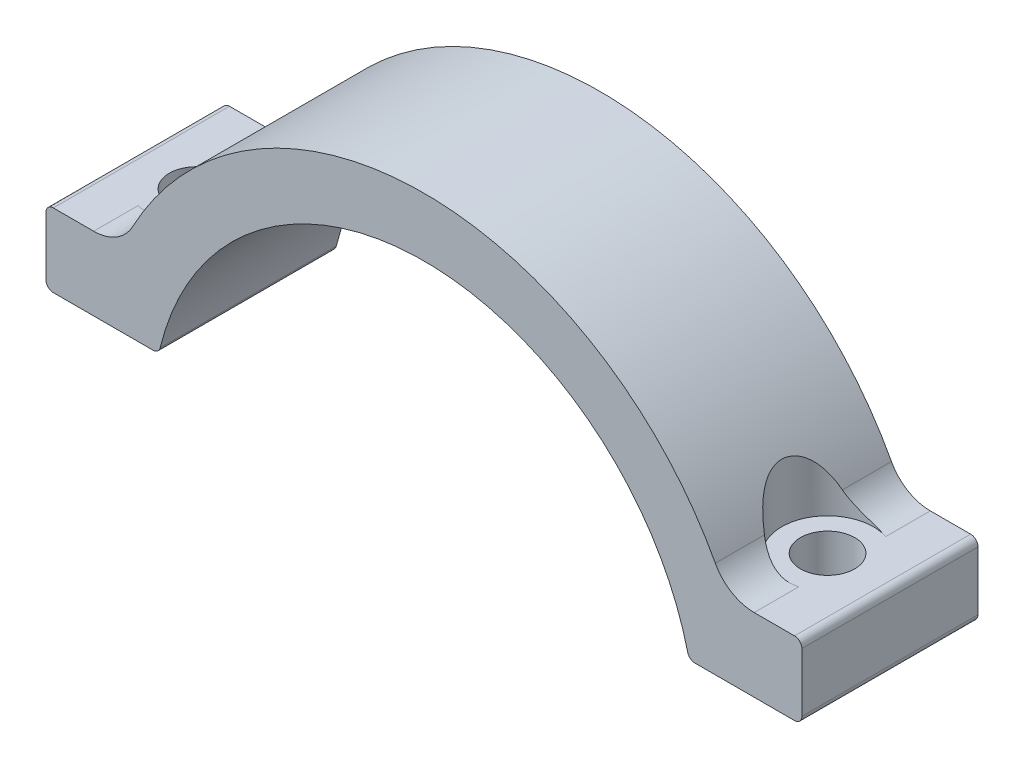
ISO-10303-21;
HEADER;
FILE_DESCRIPTION(('STEP AP214'),'2;1');
FILE_NAME('part.step','',(''),(''),'','','');
FILE_SCHEMA(('AUTOMOTIVE_DESIGN { 1 0 10303 214 1 1 1 1 }'));
ENDSEC;
DATA;
#1=APPLICATION_CONTEXT('core data for automotive mechanical design processes');
#2=APPLICATION_PROTOCOL_DEFINITION('international standard','automotive_design',2000,#1);
#3=PRODUCT_CONTEXT('',#1,'mechanical');
#4=PRODUCT('Part','Part','',(#3));
#5=PRODUCT_RELATED_PRODUCT_CATEGORY('part','',(#4));
#6=PRODUCT_DEFINITION_FORMATION('','',#4);
#7=PRODUCT_DEFINITION_CONTEXT('part definition',#1,'design');
#8=PRODUCT_DEFINITION('design','',#6,#7);
#9=PRODUCT_DEFINITION_SHAPE('','',#8);
#10=(LENGTH_UNIT() NAMED_UNIT(*) SI_UNIT(.MILLI.,.METRE.));
#11=(NAMED_UNIT(*) PLANE_ANGLE_UNIT() SI_UNIT($,.RADIAN.));
#12=(NAMED_UNIT(*) SI_UNIT($,.STERADIAN.) SOLID_ANGLE_UNIT());
#13=UNCERTAINTY_MEASURE_WITH_UNIT(LENGTH_MEASURE(1.E-05),#10,'distance_accuracy_value','');
#14=(GEOMETRIC_REPRESENTATION_CONTEXT(3) GLOBAL_UNCERTAINTY_ASSIGNED_CONTEXT((#13)) GLOBAL_UNIT_ASSIGNED_CONTEXT((#10,
#11,#12)) REPRESENTATION_CONTEXT('',''));
#15=CARTESIAN_POINT('',(0.,0.,0.));
#16=DIRECTION('',(0.,0.,1.));
#17=DIRECTION('',(1.,0.,0.));
#18=AXIS2_PLACEMENT_3D('',#15,#16,#17);
#19=CARTESIAN_POINT('',(21.5,16.,0.));
#20=DIRECTION('',(0.,1.,0.));
#21=DIRECTION('',(0.,0.,1.));
#22=AXIS2_PLACEMENT_3D('',#19,#20,#21);
#23=CYLINDRICAL_SURFACE('',#22,3.124999973);
#24=CARTESIAN_POINT('',(19.8529411764706,6.58823529411761,2.65571498152267));
#25=CARTESIAN_POINT('',(19.8920781094993,6.51487753456546,2.67999030792924));
#26=CARTESIAN_POINT('',(19.9341389070423,6.44333371631151,2.70487575965419));
#27=CARTESIAN_POINT('',(20.0240110827139,6.3040137521799,2.75494546873446));
#28=CARTESIAN_POINT('',(20.0718250480102,6.23623932155781,2.78012985589634));
#29=CARTESIAN_POINT('',(20.2249018744497,6.03730703423959,2.85530696334734));
#30=CARTESIAN_POINT('',(20.3388613070314,5.91230098157151,2.90429929640925));
#31=CARTESIAN_POINT('',(20.5891505198039,5.6810095636425,2.99225598345711));
#32=CARTESIAN_POINT('',(20.7255814303287,5.57481355356508,3.03117285836352));
#33=CARTESIAN_POINT('',(20.9438539742872,5.43370253366546,3.07600769508487));
#34=CARTESIAN_POINT('',(21.018626863033,5.38980555668679,3.08867712771184));
#35=CARTESIAN_POINT('',(21.172228722284,5.30842985878955,3.10872431854378));
#36=CARTESIAN_POINT('',(21.2510530519513,5.27094399815755,3.11610799280413));
#37=CARTESIAN_POINT('',(21.3591831151485,5.22521259415585,3.12194940729997));
#38=CARTESIAN_POINT('',(21.3870907298733,5.21390263064233,3.12308564190363));
#39=CARTESIAN_POINT('',(21.4432712206021,5.19211214083195,3.12461171477608));
#40=CARTESIAN_POINT('',(21.4715443719884,5.18163228805802,3.12500095278641));
#41=CARTESIAN_POINT('',(21.6176965000103,5.12996572639633,3.12499591669571));
#42=CARTESIAN_POINT('',(21.7382032084086,5.09567570689726,3.11830468931954));
#43=CARTESIAN_POINT('',(21.9810181762615,5.04261753281015,3.0901749884772));
#44=CARTESIAN_POINT('',(22.1033278916025,5.02386271017067,3.06872387725488));
#45=CARTESIAN_POINT('',(22.2708756036,5.00839569834034,3.02880756680948));
#46=CARTESIAN_POINT('',(22.3171505039234,5.00522228557254,3.01665175064189));
#47=CARTESIAN_POINT('',(22.4090607040716,5.00102765695331,2.9902354828748));
#48=CARTESIAN_POINT('',(22.4546973839482,5.00000070534107,2.97598074952103));
#49=CARTESIAN_POINT('',(22.4999985267468,5.00000000000036,2.96068028968923));
#50=B_SPLINE_CURVE_WITH_KNOTS('',3,(#24,#25,#26,#27,#28,#29,#30,#31,#32,#33,#34,#35,#36,#37,#38,
#39,#40,#41,#42,#43,#44,#45,#46,#47,#48,#49),.UNSPECIFIED.,.F.,.F.,(4,2,2,2,2,2,2,2,2,2,2,2,4),
(0.,0.259694540226182,0.519506303202874,1.04533013778207,1.57358850123147,1.83607602251771,
2.09826929483037,2.18865188936675,2.27910708160784,2.65356339005359,3.02834071633228,
3.17211213946567,3.31549888369353),.UNSPECIFIED.);
#51=CARTESIAN_POINT('',(19.8529411764706,6.58823529411763,2.65571498152266));
#52=VERTEX_POINT('',#51);
#53=CARTESIAN_POINT('',(22.499998158362,5.000000078,2.9606804141141));
#54=VERTEX_POINT('',#53);
#55=EDGE_CURVE('E237',#52,#54,#50,.T.);
#56=ORIENTED_EDGE('',*,*,#55,.T.);
#57=CARTESIAN_POINT('',(21.5,5.000000156,0.));
#58=DIRECTION('',(0.,1.,0.));
#59=DIRECTION('',(0.,0.,1.));
#60=AXIS2_PLACEMENT_3D('',#57,#58,#59);
#61=CIRCLE('',#60,3.124999973);
#62=CARTESIAN_POINT('',(22.4999987771713,5.00000005178879,-2.96080443941355));
#63=VERTEX_POINT('',#62);
#64=EDGE_CURVE('E242',#54,#63,#61,.F.);
#65=ORIENTED_EDGE('',*,*,#64,.T.);
#66=CARTESIAN_POINT('',(22.4999611139855,5.00000000025202,-2.96069292594941));
#67=CARTESIAN_POINT('',(22.4405723898165,4.99998887790282,-2.98076450661719));
#68=CARTESIAN_POINT('',(22.3805645614575,5.00176467046286,-2.99902808956596));
#69=CARTESIAN_POINT('',(22.2597413929983,5.00902668583251,-3.03188358947512));
#70=CARTESIAN_POINT('',(22.1989256576369,5.014514795721,-3.04647363389053));
#71=CARTESIAN_POINT('',(22.0773627590128,5.02929165176531,-3.07182574473477));
#72=CARTESIAN_POINT('',(22.0166175762853,5.03855624295259,-3.08261134188317));
#73=CARTESIAN_POINT('',(21.8953263176081,5.06092395670118,-3.10049933661798));
#74=CARTESIAN_POINT('',(21.8347801468096,5.07402485573171,-3.10760386117312));
#75=CARTESIAN_POINT('',(21.7282979099296,5.1005600901545,-3.1169956253903));
#76=CARTESIAN_POINT('',(21.6822288561805,5.11321301049284,-3.12001782360413));
#77=CARTESIAN_POINT('',(21.5906497844057,5.14074036535155,-3.12402226103625));
#78=CARTESIAN_POINT('',(21.5451400308609,5.15561581018278,-3.12500356946822));
#79=CARTESIAN_POINT('',(21.4284649658354,5.19687028748763,-3.12500339570786));
#80=CARTESIAN_POINT('',(21.3578669818989,5.22488790152946,-3.12253771139284));
#81=CARTESIAN_POINT('',(21.2192292227496,5.28607418333002,-3.11313801104424));
#82=CARTESIAN_POINT('',(21.1511913762788,5.31924664178451,-3.10620069481222));
#83=CARTESIAN_POINT('',(20.9513996108179,5.42616579832855,-3.07939956032397));
#84=CARTESIAN_POINT('',(20.8242506757207,5.50721327720102,-3.05355035912359));
#85=CARTESIAN_POINT('',(20.5864583874196,5.68477355255953,-2.99100534334149));
#86=CARTESIAN_POINT('',(20.4756773683158,5.78114129267246,-2.95440877659872));
#87=CARTESIAN_POINT('',(20.2704466838855,5.98748310502331,-2.87504596703094));
#88=CARTESIAN_POINT('',(20.1759790090353,6.09744193984825,-2.83228662471535));
#89=CARTESIAN_POINT('',(20.0459449207383,6.27283288487622,-2.76655011639467));
#90=CARTESIAN_POINT('',(20.004085974742,6.33389416879613,-2.74407201480064));
#91=CARTESIAN_POINT('',(19.92502972259,6.45890573309817,-2.69947177006923));
#92=CARTESIAN_POINT('',(19.887823531304,6.52285017964949,-2.67734902102541));
#93=CARTESIAN_POINT('',(19.8529411764706,6.58823529411757,-2.65571498152268));
#94=B_SPLINE_CURVE_WITH_KNOTS('',3,(#66,#67,#68,#69,#70,#71,#72,#73,#74,#75,#76,#77,#78,#79,#80,
#81,#82,#83,#84,#85,#86,#87,#88,#89,#90,#91,#92,#93),.UNSPECIFIED.,.F.,.F.,(4,2,2,2,2,2,2,2,2,2,
2,2,2,4),(0.,0.188024105822827,0.376143861665363,0.563078796674835,0.749905597600661,
0.893420203269972,1.03700024714419,1.26458113944053,1.49233018587098,1.94871641429392,
2.4010139480001,2.8528089192811,3.08474942469126,3.3162400124577),.UNSPECIFIED.);
#95=CARTESIAN_POINT('',(19.8529411764706,6.58823529411757,-2.65571498152268));
#96=VERTEX_POINT('',#95);
#97=EDGE_CURVE('E335',#63,#96,#94,.T.);
#98=ORIENTED_EDGE('',*,*,#97,.T.);
#99=CARTESIAN_POINT('',(19.8529411764706,6.58823529411761,2.65571498152267));
#100=CARTESIAN_POINT('',(19.816469666707,6.6566204307584,2.6330917713851));
#101=CARTESIAN_POINT('',(19.7798037269385,6.72451661172181,2.60931549629452));
#102=CARTESIAN_POINT('',(19.7061630304444,6.85923721460095,2.55925003949798));
#103=CARTESIAN_POINT('',(19.6691881744957,6.92606127031289,2.53296001965382));
#104=CARTESIAN_POINT('',(19.5575390108029,7.12546309479266,2.44972093739964));
#105=CARTESIAN_POINT('',(19.4825537161557,7.25619616690696,2.3886534670583));
#106=CARTESIAN_POINT('',(19.3316590135644,7.51345242353353,2.25264889854558));
#107=CARTESIAN_POINT('',(19.2557562786011,7.63986251559669,2.17748860969635));
#108=CARTESIAN_POINT('',(19.1063246895172,7.88354591732747,2.01204674462127));
#109=CARTESIAN_POINT('',(19.0327899757857,8.00084298968834,1.92180657117554));
#110=CARTESIAN_POINT('',(18.9318442364886,8.15888144535122,1.78124269019669));
#111=CARTESIAN_POINT('',(18.9023548137475,8.20466319233931,1.73801878291661));
#112=CARTESIAN_POINT('',(18.8445435910911,8.29373799662982,1.64833957915152));
#113=CARTESIAN_POINT('',(18.816221866453,8.33703089355626,1.60188407485489));
#114=CARTESIAN_POINT('',(18.7336311095318,8.46238402300342,1.45776432524967));
#115=CARTESIAN_POINT('',(18.6815295585943,8.54024109664914,1.35506607783926));
#116=CARTESIAN_POINT('',(18.5856243587585,8.68195628990993,1.13430652258093));
#117=CARTESIAN_POINT('',(18.5419433650117,8.74560934629763,1.01605505618366));
#118=CARTESIAN_POINT('',(18.4863645069398,8.82596579943541,0.829368355040395));
#119=CARTESIAN_POINT('',(18.4694978948331,8.85022715589567,0.765602638571849));
#120=CARTESIAN_POINT('',(18.4395453479116,8.89317057854466,0.635377413788864));
#121=CARTESIAN_POINT('',(18.4264578503593,8.91185495103305,0.568919031945583));
#122=CARTESIAN_POINT('',(18.3993743920121,8.9504376010663,0.402242515551578));
#123=CARTESIAN_POINT('',(18.3878146255899,8.96681900854814,0.300767960581489));
#124=CARTESIAN_POINT('',(18.3747879886154,8.98527241225864,0.0959349221375464));
#125=CARTESIAN_POINT('',(18.3733159536642,8.98735173042242,-0.0074225701902728));
#126=CARTESIAN_POINT('',(18.3805726975854,8.97707911283496,-0.213014144105989));
#127=CARTESIAN_POINT('',(18.3892983925873,8.96473153988474,-0.315248555886697));
#128=CARTESIAN_POINT('',(18.416206664836,8.92647927680355,-0.51585417689658));
#129=CARTESIAN_POINT('',(18.4343942884768,8.90056735225985,-0.614223294482389));
#130=CARTESIAN_POINT('',(18.4795162483935,8.83585060080591,-0.807755235299555));
#131=CARTESIAN_POINT('',(18.5066882722243,8.7966946657342,-0.902743124444346));
#132=CARTESIAN_POINT('',(18.5678580226087,8.707775865836,-1.08509432166317));
#133=CARTESIAN_POINT('',(18.6018537602963,8.65801609138543,-1.17245984076251));
#134=CARTESIAN_POINT('',(18.6978800395477,8.51600697437626,-1.39126756432365));
#135=CARTESIAN_POINT('',(18.7641697544556,8.41661588769717,-1.51620723101444));
#136=CARTESIAN_POINT('',(18.9050636467446,8.20103746307037,-1.7465260907328));
#137=CARTESIAN_POINT('',(18.9797258135602,8.08473108233849,-1.85175342464139));
#138=CARTESIAN_POINT('',(19.1214698906392,7.85893902762125,-2.02955664680287));
#139=CARTESIAN_POINT('',(19.1880018833681,7.75106050443792,-2.10466312780188));
#140=CARTESIAN_POINT('',(19.3223987861146,7.52873847171447,-2.24343958542842));
#141=CARTESIAN_POINT('',(19.3902655981622,7.41428506856189,-2.30709169798858));
#142=CARTESIAN_POINT('',(19.5245012081146,7.18308059311626,-2.42295824787583));
#143=CARTESIAN_POINT('',(19.5908689471603,7.06644109265621,-2.47540002013258));
#144=CARTESIAN_POINT('',(19.7226984819885,6.8297552711605,-2.57165009555213));
#145=CARTESIAN_POINT('',(19.7881626712043,6.70972264884614,-2.6154886488346));
#146=CARTESIAN_POINT('',(19.8529411764706,6.58823529411757,-2.65571498152269));
#147=B_SPLINE_CURVE_WITH_KNOTS('',3,(#99,#100,#101,#102,#103,#104,#105,#106,#107,#108,#109,#110,
#111,#112,#113,#114,#115,#116,#117,#118,#119,#120,#121,#122,#123,#124,#125,#126,#127,#128,#129,
#130,#131,#132,#133,#134,#135,#136,#137,#138,#139,#140,#141,#142,#143,#144,#145,#146),
.UNSPECIFIED.,.F.,.F.,(4,2,2,2,2,2,2,2,2,2,2,2,2,2,2,2,2,2,2,2,2,2,2,4),(0.,0.242191341778566,
0.484463718991839,0.971741314902481,1.46751197924966,1.96194318840496,2.17041114975584,
2.37889252929649,2.79444097501855,3.21564802132588,3.42616068691039,3.63658617632711,
3.94539573375019,4.25404718476646,4.56260532140151,4.87132819238534,5.18897708776863,
5.50653353406748,6.02218824924471,6.54166530986681,6.98297400113076,7.42496509626059,
7.8568971801909,8.28728219327679),.UNSPECIFIED.);
#148=EDGE_CURVE('E233',#52,#96,#147,.T.);
#149=ORIENTED_EDGE('',*,*,#148,.F.);
#150=EDGE_LOOP('',(#56,#65,#98,#149));
#151=FACE_BOUND('',#150,.T.);
#152=ADVANCED_FACE('F14',(#151),#23,.F.);
#153=CARTESIAN_POINT('',(-21.5,16.,0.));
#154=DIRECTION('',(0.,1.,0.));
#155=DIRECTION('',(0.,0.,1.));
#156=AXIS2_PLACEMENT_3D('',#153,#154,#155);
#157=CYLINDRICAL_SURFACE('',#156,3.124999973);
#158=CARTESIAN_POINT('',(-22.499998536605,5.00000003119989,2.96068031929062));
#159=CARTESIAN_POINT('',(-22.4406099990688,4.99998817154151,2.98075267890423));
#160=CARTESIAN_POINT('',(-22.3806023041315,5.00176318481452,2.99901702635265));
#161=CARTESIAN_POINT('',(-22.2597793107503,5.00902362801093,3.03187407381437));
#162=CARTESIAN_POINT('',(-22.1989636170038,5.01451094497957,3.04646490131872));
#163=CARTESIAN_POINT('',(-22.0774006768684,5.02928628330548,3.07181864851276));
#164=CARTESIAN_POINT('',(-22.0166554112658,5.03855015225284,3.08260509566519));
#165=CARTESIAN_POINT('',(-21.8953637942989,5.06091616047165,3.10049447473786));
#166=CARTESIAN_POINT('',(-21.8348173481986,5.07401607640233,3.10759953377217));
#167=CARTESIAN_POINT('',(-21.7283255990484,5.10055281237428,3.11699398668421));
#168=CARTESIAN_POINT('',(-21.6822473316431,5.11320845124196,3.12001770090253));
#169=CARTESIAN_POINT('',(-21.5906491521919,5.14073956100516,3.12402160355263));
#170=CARTESIAN_POINT('',(-21.5451295042162,5.15561604106674,3.12500085992097));
#171=CARTESIAN_POINT('',(-21.4284447760832,5.196873281839,3.12499856738199));
#172=CARTESIAN_POINT('',(-21.3578477218238,5.22489451544327,3.1225356494578));
#173=CARTESIAN_POINT('',(-21.2192105376052,5.28608431985702,3.11313750027757));
#174=CARTESIAN_POINT('',(-21.1511723362572,5.31925668018474,3.1061989645052));
#175=CARTESIAN_POINT('',(-20.9513799684373,5.42617660734552,3.07939527744612));
#176=CARTESIAN_POINT('',(-20.8242312741671,5.50722601633853,3.05354585866783));
#177=CARTESIAN_POINT('',(-20.5864394517983,5.68478943082776,2.99099976186109));
#178=CARTESIAN_POINT('',(-20.4756586594944,5.78115838812692,2.95440233622458));
#179=CARTESIAN_POINT('',(-20.2704287882439,5.98750280907188,2.87503825473775));
#180=CARTESIAN_POINT('',(-20.1759616900654,6.09746302711194,2.83227850251952));
#181=CARTESIAN_POINT('',(-20.0459316368905,6.27285197032742,2.76654307507206));
#182=CARTESIAN_POINT('',(-20.0040757680808,6.33390967243067,2.7440664014066));
#183=CARTESIAN_POINT('',(-19.9250250624831,6.45891373535674,2.69946899660184));
#184=CARTESIAN_POINT('',(-19.8878213450563,6.52285426532679,2.67734765978022));
#185=CARTESIAN_POINT('',(-19.8529411764706,6.58823529411754,2.65571498152269));
#186=B_SPLINE_CURVE_WITH_KNOTS('',3,(#158,#159,#160,#161,#162,#163,#164,#165,#166,#167,#168,
#169,#170,#171,#172,#173,#174,#175,#176,#177,#178,#179,#180,#181,#182,#183,#184,#185),
.UNSPECIFIED.,.F.,.F.,(4,2,2,2,2,2,2,2,2,2,2,2,2,4),(0.,0.188024325081057,0.37614429892747,
0.563079594275378,0.749906757213932,0.893450354519204,1.03705937872928,1.26464139837043,
1.49239164297864,1.94878034380683,2.4010803782355,2.85287758572648,3.08480340892054,
3.31627951432019),.UNSPECIFIED.);
#187=CARTESIAN_POINT('',(-22.4999992633106,5.00000007800018,2.96068004090744));
#188=VERTEX_POINT('',#187);
#189=CARTESIAN_POINT('',(-19.8529411764706,6.5882352941176,2.65571498152268));
#190=VERTEX_POINT('',#189);
#191=EDGE_CURVE('E217',#188,#190,#186,.T.);
#192=ORIENTED_EDGE('',*,*,#191,.T.);
#193=CARTESIAN_POINT('',(-19.8529411764706,6.58823529411758,-2.65571498152268));
#194=CARTESIAN_POINT('',(-19.816469666707,6.65662043075837,-2.63309177138511));
#195=CARTESIAN_POINT('',(-19.7798037269385,6.72451661172178,-2.60931549629453));
#196=CARTESIAN_POINT('',(-19.7061630304444,6.85923721460092,-2.55925003949799));
#197=CARTESIAN_POINT('',(-19.6691881744957,6.92606127031286,-2.53296001965383));
#198=CARTESIAN_POINT('',(-19.5575390108029,7.12546309479264,-2.44972093739965));
#199=CARTESIAN_POINT('',(-19.4825537161557,7.25619616690694,-2.38865346705831));
#200=CARTESIAN_POINT('',(-19.3316590135644,7.51345242353351,-2.25264889854559));
#201=CARTESIAN_POINT('',(-19.2557562786011,7.63986251559667,-2.17748860969636));
#202=CARTESIAN_POINT('',(-19.1063246895173,7.88354591732746,-2.01204674462128));
#203=CARTESIAN_POINT('',(-19.0327899757857,8.00084298968833,-1.92180657117555));
#204=CARTESIAN_POINT('',(-18.9318442364886,8.15888144535121,-1.7812426901967));
#205=CARTESIAN_POINT('',(-18.9023548137475,8.20466319233931,-1.73801878291662));
#206=CARTESIAN_POINT('',(-18.8445435910911,8.29373799662981,-1.64833957915153));
#207=CARTESIAN_POINT('',(-18.816221866453,8.33703089355625,-1.6018840748549));
#208=CARTESIAN_POINT('',(-18.7336311095318,8.4623840230034,-1.45776432524968));
#209=CARTESIAN_POINT('',(-18.6815295585943,8.54024109664914,-1.35506607783927));
#210=CARTESIAN_POINT('',(-18.5856243587585,8.68195628990993,-1.13430652258094));
#211=CARTESIAN_POINT('',(-18.5419433650117,8.74560934629762,-1.01605505618367));
#212=CARTESIAN_POINT('',(-18.4863645069399,8.82596579943541,-0.829368355040403));
#213=CARTESIAN_POINT('',(-18.4694978948331,8.85022715589566,-0.765602638571857));
#214=CARTESIAN_POINT('',(-18.4395453479116,8.89317057854465,-0.635377413788872));
#215=CARTESIAN_POINT('',(-18.4264578503593,8.91185495103304,-0.568919031945591));
#216=CARTESIAN_POINT('',(-18.3993743920121,8.9504376010663,-0.402242515551585));
#217=CARTESIAN_POINT('',(-18.3878146255899,8.96681900854814,-0.300767960581496));
#218=CARTESIAN_POINT('',(-18.3747879886154,8.98527241225864,-0.0959349221375543));
#219=CARTESIAN_POINT('',(-18.3733159536642,8.98735173042242,0.0074225701902652));
#220=CARTESIAN_POINT('',(-18.3805726975854,8.97707911283496,0.213014144105982));
#221=CARTESIAN_POINT('',(-18.3892983925873,8.96473153988474,0.315248555886691));
#222=CARTESIAN_POINT('',(-18.416206664836,8.92647927680355,0.515854176896574));
#223=CARTESIAN_POINT('',(-18.4343942884768,8.90056735225985,0.614223294482383));
#224=CARTESIAN_POINT('',(-18.4795162483935,8.83585060080591,0.80775523529955));
#225=CARTESIAN_POINT('',(-18.5066882722243,8.7966946657342,0.902743124444341));
#226=CARTESIAN_POINT('',(-18.5678580226087,8.707775865836,1.08509432166317));
#227=CARTESIAN_POINT('',(-18.6018537602963,8.65801609138543,1.1724598407625));
#228=CARTESIAN_POINT('',(-18.6978800395477,8.51600697437626,1.39126756432364));
#229=CARTESIAN_POINT('',(-18.7641697544556,8.41661588769717,1.51620723101443));
#230=CARTESIAN_POINT('',(-18.9050636467446,8.20103746307038,1.74652609073279));
#231=CARTESIAN_POINT('',(-18.9797258135602,8.0847310823385,1.85175342464139));
#232=CARTESIAN_POINT('',(-19.1214698906392,7.85893902762125,2.02955664680287));
#233=CARTESIAN_POINT('',(-19.1880018833681,7.75106050443793,2.10466312780188));
#234=CARTESIAN_POINT('',(-19.3223987861146,7.52873847171446,2.24343958542843));
#235=CARTESIAN_POINT('',(-19.3902655981622,7.41428506856188,2.30709169798859));
#236=CARTESIAN_POINT('',(-19.5245012081146,7.18308059311624,2.42295824787583));
#237=CARTESIAN_POINT('',(-19.5908689471603,7.06644109265619,2.47540002013259));
#238=CARTESIAN_POINT('',(-19.7226984819886,6.82975527116048,2.57165009555214));
#239=CARTESIAN_POINT('',(-19.7881626712043,6.70972264884612,2.6154886488346));
#240=CARTESIAN_POINT('',(-19.8529411764706,6.58823529411754,2.65571498152269));
#241=B_SPLINE_CURVE_WITH_KNOTS('',3,(#193,#194,#195,#196,#197,#198,#199,#200,#201,#202,#203,
#204,#205,#206,#207,#208,#209,#210,#211,#212,#213,#214,#215,#216,#217,#218,#219,#220,#221,#222,
#223,#224,#225,#226,#227,#228,#229,#230,#231,#232,#233,#234,#235,#236,#237,#238,#239,#240),
.UNSPECIFIED.,.F.,.F.,(4,2,2,2,2,2,2,2,2,2,2,2,2,2,2,2,2,2,2,2,2,2,2,4),(0.,0.242191341778567,
0.484463718991838,0.971741314902488,1.46751197924967,1.96194318840498,2.17041114975586,
2.37889252929651,2.79444097501857,3.2156480213259,3.42616068691041,3.63658617632713,
3.94539573375021,4.25404718476648,4.56260532140153,4.87132819238536,5.18897708776865,
5.5065335340675,6.02218824924473,6.54166530986683,6.9829740011308,7.42496509626064,
7.85689718019096,8.28728219327685),.UNSPECIFIED.);
#242=CARTESIAN_POINT('',(-19.8529411764706,6.58823529411762,-2.65571498152267));
#243=VERTEX_POINT('',#242);
#244=EDGE_CURVE('E227',#243,#190,#241,.T.);
#245=ORIENTED_EDGE('',*,*,#244,.F.);
#246=CARTESIAN_POINT('',(-19.8529411764706,6.58823529411758,-2.65571498152268));
#247=CARTESIAN_POINT('',(-19.8920781103441,6.51487753299697,-2.67999030844833));
#248=CARTESIAN_POINT('',(-19.9341389088426,6.44333371325629,-2.70487576071701));
#249=CARTESIAN_POINT('',(-20.0240110865607,6.30401374648179,-2.7549454708178));
#250=CARTESIAN_POINT('',(-20.0718250529345,6.23623931469465,-2.7801298584558));
#251=CARTESIAN_POINT('',(-20.2249018790103,6.03730702925174,-2.8553069653016));
#252=CARTESIAN_POINT('',(-20.338861309621,5.91230097922691,-2.90429929729123));
#253=CARTESIAN_POINT('',(-20.5891505184661,5.68100956483007,-2.99225598301518));
#254=CARTESIAN_POINT('',(-20.7255814272505,5.57481355583461,-3.03117285756769));
#255=CARTESIAN_POINT('',(-20.9438539698108,5.43370253642,-3.07600769424702));
#256=CARTESIAN_POINT('',(-21.018626858531,5.38980555931222,-3.08867712695832));
#257=CARTESIAN_POINT('',(-21.1722287179773,5.30842986083161,-3.10872431814709));
#258=CARTESIAN_POINT('',(-21.2510530479822,5.27094399992038,-3.11610799253424));
#259=CARTESIAN_POINT('',(-21.3591870316236,5.22521093773359,-3.12194961889536));
#260=CARTESIAN_POINT('',(-21.3870986165194,5.21389943436714,-3.12308596306841));
#261=CARTESIAN_POINT('',(-21.443287145359,5.19210610186632,-3.12461204009541));
#262=CARTESIAN_POINT('',(-21.4715643647992,5.18162494654718,-3.12500117242904));
#263=CARTESIAN_POINT('',(-21.6177207833416,5.1299582698111,-3.12499500843046));
#264=CARTESIAN_POINT('',(-21.7382275481841,5.09566933528549,-3.11830283167634));
#265=CARTESIAN_POINT('',(-21.9810423280146,5.04261330926948,-3.09017122842701));
#266=CARTESIAN_POINT('',(-22.1033517979485,5.0238595430378,-3.0687191704818));
#267=CARTESIAN_POINT('',(-22.2708887521002,5.00839485506634,-3.02880405280873));
#268=CARTESIAN_POINT('',(-22.3171533353367,5.00522226934616,-3.01665081512555));
#269=CARTESIAN_POINT('',(-22.409043181293,5.00102834428641,-2.99024064025857));
#270=CARTESIAN_POINT('',(-22.4546698232775,5.00000127233242,-2.97598941817896));
#271=CARTESIAN_POINT('',(-22.499961107722,5.0000000002521,-2.96069292806487));
#272=B_SPLINE_CURVE_WITH_KNOTS('',3,(#246,#247,#248,#249,#250,#251,#252,#253,#254,#255,#256,
#257,#258,#259,#260,#261,#262,#263,#264,#265,#266,#267,#268,#269,#270,#271),.UNSPECIFIED.,.F.,
.F.,(4,2,2,2,2,2,2,2,2,2,2,2,4),(0.,0.259694545764119,0.519506313669218,1.04533013780934,
1.57358849609362,1.83607601634251,2.098269294874,2.18866465740401,2.27913263865612,
2.65358838798779,3.02836499436367,3.17210448259802,3.31545941838996),.UNSPECIFIED.);
#273=CARTESIAN_POINT('',(-22.4999987772272,5.00000005178883,-2.96080446024015));
#274=VERTEX_POINT('',#273);
#275=EDGE_CURVE('E330',#243,#274,#272,.T.);
#276=ORIENTED_EDGE('',*,*,#275,.T.);
#277=CARTESIAN_POINT('',(-21.5,5.000000156,0.));
#278=DIRECTION('',(0.,1.,0.));
#279=DIRECTION('',(0.,0.,1.));
#280=AXIS2_PLACEMENT_3D('',#277,#278,#279);
#281=CIRCLE('',#280,3.124999973);
#282=EDGE_CURVE('E213',#274,#188,#281,.F.);
#283=ORIENTED_EDGE('',*,*,#282,.T.);
#284=EDGE_LOOP('',(#192,#245,#276,#283));
#285=FACE_BOUND('',#284,.T.);
#286=ADVANCED_FACE('F298',(#285),#157,.F.);
#287=CARTESIAN_POINT('',(-25.25,4.5,-6.));
#288=DIRECTION('',(0.,0.,1.));
#289=DIRECTION('',(1.,0.,0.));
#290=AXIS2_PLACEMENT_3D('',#287,#288,#289);
#291=CYLINDRICAL_SURFACE('',#290,0.5);
#292=DIRECTION('',(0.,0.,1.));
#293=VECTOR('',#292,1.);
#294=CARTESIAN_POINT('',(-25.75,4.5,-6.));
#295=LINE('',#294,#293);
#296=CARTESIAN_POINT('',(-25.75,4.5,6.));
#297=VERTEX_POINT('',#296);
#298=CARTESIAN_POINT('',(-25.75,4.5,-6.));
#299=VERTEX_POINT('',#298);
#300=EDGE_CURVE('E152',#297,#299,#295,.F.);
#301=ORIENTED_EDGE('',*,*,#300,.F.);
#302=CARTESIAN_POINT('',(-25.25,4.5,6.));
#303=DIRECTION('',(0.,0.,1.));
#304=DIRECTION('',(1.,0.,0.));
#305=AXIS2_PLACEMENT_3D('',#302,#303,#304);
#306=CIRCLE('',#305,0.5);
#307=CARTESIAN_POINT('',(-25.25,5.,6.));
#308=VERTEX_POINT('',#307);
#309=EDGE_CURVE('E157',#297,#308,#306,.F.);
#310=ORIENTED_EDGE('',*,*,#309,.T.);
#311=DIRECTION('',(0.,0.,-1.));
#312=VECTOR('',#311,1.);
#313=CARTESIAN_POINT('',(-25.25,5.,6.));
#314=LINE('',#313,#312);
#315=CARTESIAN_POINT('',(-25.25,5.,-6.));
#316=VERTEX_POINT('',#315);
#317=EDGE_CURVE('E155',#308,#316,#314,.T.);
#318=ORIENTED_EDGE('',*,*,#317,.T.);
#319=CARTESIAN_POINT('',(-25.25,4.5,-6.));
#320=DIRECTION('',(0.,0.,1.));
#321=DIRECTION('',(1.,0.,0.));
#322=AXIS2_PLACEMENT_3D('',#319,#320,#321);
#323=CIRCLE('',#322,0.5);
#324=EDGE_CURVE('E146',#316,#299,#323,.T.);
#325=ORIENTED_EDGE('',*,*,#324,.T.);
#326=EDGE_LOOP('',(#301,#310,#318,#325));
#327=FACE_BOUND('',#326,.T.);
#328=ADVANCED_FACE('F151',(#327),#291,.T.);
#329=CARTESIAN_POINT('',(-25.25,0.500000000000001,-6.));
#330=DIRECTION('',(0.,0.,1.));
#331=DIRECTION('',(1.,0.,0.));
#332=AXIS2_PLACEMENT_3D('',#329,#330,#331);
#333=CYLINDRICAL_SURFACE('',#332,0.5);
#334=DIRECTION('',(0.,0.,1.));
#335=VECTOR('',#334,1.);
#336=CARTESIAN_POINT('',(-25.75,0.5,-6.));
#337=LINE('',#336,#335);
#338=CARTESIAN_POINT('',(-25.75,0.500000000000001,-6.));
#339=VERTEX_POINT('',#338);
#340=CARTESIAN_POINT('',(-25.75,0.500000000000001,6.));
#341=VERTEX_POINT('',#340);
#342=EDGE_CURVE('E167',#339,#341,#337,.T.);
#343=ORIENTED_EDGE('',*,*,#342,.F.);
#344=CARTESIAN_POINT('',(-25.25,0.500000000000001,-6.));
#345=DIRECTION('',(0.,0.,1.));
#346=DIRECTION('',(1.,0.,0.));
#347=AXIS2_PLACEMENT_3D('',#344,#345,#346);
#348=CIRCLE('',#347,0.5);
#349=CARTESIAN_POINT('',(-25.25,0.,-6.));
#350=VERTEX_POINT('',#349);
#351=EDGE_CURVE('E172',#339,#350,#348,.T.);
#352=ORIENTED_EDGE('',*,*,#351,.T.);
#353=DIRECTION('',(0.,0.,-1.));
#354=VECTOR('',#353,1.);
#355=CARTESIAN_POINT('',(-25.25,0.,-6.));
#356=LINE('',#355,#354);
#357=CARTESIAN_POINT('',(-25.25,0.,6.));
#358=VERTEX_POINT('',#357);
#359=EDGE_CURVE('E166',#358,#350,#356,.T.);
#360=ORIENTED_EDGE('',*,*,#359,.F.);
#361=CARTESIAN_POINT('',(-25.25,0.500000000000001,6.));
#362=DIRECTION('',(0.,0.,1.));
#363=DIRECTION('',(1.,0.,0.));
#364=AXIS2_PLACEMENT_3D('',#361,#362,#363);
#365=CIRCLE('',#364,0.5);
#366=EDGE_CURVE('E449',#358,#341,#365,.F.);
#367=ORIENTED_EDGE('',*,*,#366,.T.);
#368=EDGE_LOOP('',(#343,#352,#360,#367));
#369=FACE_BOUND('',#368,.T.);
#370=ADVANCED_FACE('F369',(#369),#333,.T.);
#371=CARTESIAN_POINT('',(-21.5,16.,0.));
#372=DIRECTION('',(0.,1.,0.));
#373=DIRECTION('',(0.,0.,1.));
#374=AXIS2_PLACEMENT_3D('',#371,#372,#373);
#375=CYLINDRICAL_SURFACE('',#374,1.849999983);
#376=CARTESIAN_POINT('',(-21.5,0.,0.));
#377=DIRECTION('',(0.,1.,0.));
#378=DIRECTION('',(0.,0.,1.));
#379=AXIS2_PLACEMENT_3D('',#376,#377,#378);
#380=CIRCLE('',#379,1.849999983);
#381=CARTESIAN_POINT('',(-21.5,0.,1.849999983));
#382=VERTEX_POINT('',#381);
#383=EDGE_CURVE('E196',#382,#382,#380,.T.);
#384=ORIENTED_EDGE('',*,*,#383,.F.);
#385=EDGE_LOOP('',(#384));
#386=FACE_BOUND('',#385,.T.);
#387=CARTESIAN_POINT('',(-21.5,5.000000156,0.));
#388=DIRECTION('',(0.,1.,0.));
#389=DIRECTION('',(0.,0.,1.));
#390=AXIS2_PLACEMENT_3D('',#387,#388,#389);
#391=CIRCLE('',#390,1.849999983);
#392=CARTESIAN_POINT('',(-21.5,5.000000156,1.849999983));
#393=VERTEX_POINT('',#392);
#394=EDGE_CURVE('E209',#393,#393,#391,.T.);
#395=ORIENTED_EDGE('',*,*,#394,.T.);
#396=EDGE_LOOP('',(#395));
#397=FACE_BOUND('',#396,.T.);
#398=ADVANCED_FACE('F365',(#386,#397),#375,.F.);
#399=CARTESIAN_POINT('',(25.25,4.5,6.));
#400=DIRECTION('',(0.,0.,-1.));
#401=DIRECTION('',(-1.,0.,0.));
#402=AXIS2_PLACEMENT_3D('',#399,#400,#401);
#403=CYLINDRICAL_SURFACE('',#402,0.5);
#404=DIRECTION('',(0.,0.,-1.));
#405=VECTOR('',#404,1.);
#406=CARTESIAN_POINT('',(25.25,5.,6.));
#407=LINE('',#406,#405);
#408=CARTESIAN_POINT('',(25.25,5.,-6.));
#409=VERTEX_POINT('',#408);
#410=CARTESIAN_POINT('',(25.25,5.,6.));
#411=VERTEX_POINT('',#410);
#412=EDGE_CURVE('E241',#409,#411,#407,.F.);
#413=ORIENTED_EDGE('',*,*,#412,.T.);
#414=CARTESIAN_POINT('',(25.25,4.5,6.));
#415=DIRECTION('',(0.,0.,-1.));
#416=DIRECTION('',(-1.,0.,0.));
#417=AXIS2_PLACEMENT_3D('',#414,#415,#416);
#418=CIRCLE('',#417,0.5);
#419=CARTESIAN_POINT('',(25.75,4.5,6.));
#420=VERTEX_POINT('',#419);
#421=EDGE_CURVE('E452',#411,#420,#418,.T.);
#422=ORIENTED_EDGE('',*,*,#421,.T.);
#423=DIRECTION('',(0.,0.,1.));
#424=VECTOR('',#423,1.);
#425=CARTESIAN_POINT('',(25.75,4.5,-6.));
#426=LINE('',#425,#424);
#427=CARTESIAN_POINT('',(25.75,4.5,-6.));
#428=VERTEX_POINT('',#427);
#429=EDGE_CURVE('E195',#420,#428,#426,.F.);
#430=ORIENTED_EDGE('',*,*,#429,.T.);
#431=CARTESIAN_POINT('',(25.25,4.5,-6.));
#432=DIRECTION('',(0.,0.,-1.));
#433=DIRECTION('',(-1.,0.,0.));
#434=AXIS2_PLACEMENT_3D('',#431,#432,#433);
#435=CIRCLE('',#434,0.5);
#436=EDGE_CURVE('E450',#428,#409,#435,.F.);
#437=ORIENTED_EDGE('',*,*,#436,.T.);
#438=EDGE_LOOP('',(#413,#422,#430,#437));
#439=FACE_BOUND('',#438,.T.);
#440=ADVANCED_FACE('F361',(#439),#403,.T.);
#441=CARTESIAN_POINT('',(25.25,0.500000000000001,-6.));
#442=DIRECTION('',(0.,0.,-1.));
#443=DIRECTION('',(-1.,0.,0.));
#444=AXIS2_PLACEMENT_3D('',#441,#442,#443);
#445=CYLINDRICAL_SURFACE('',#444,0.5);
#446=DIRECTION('',(0.,0.,-1.));
#447=VECTOR('',#446,1.);
#448=CARTESIAN_POINT('',(25.25,0.,-6.));
#449=LINE('',#448,#447);
#450=CARTESIAN_POINT('',(25.25,0.,-6.));
#451=VERTEX_POINT('',#450);
#452=CARTESIAN_POINT('',(25.25,0.,6.));
#453=VERTEX_POINT('',#452);
#454=EDGE_CURVE('E199',#451,#453,#449,.F.);
#455=ORIENTED_EDGE('',*,*,#454,.F.);
#456=CARTESIAN_POINT('',(25.25,0.500000000000001,-6.));
#457=DIRECTION('',(0.,0.,-1.));
#458=DIRECTION('',(-1.,0.,0.));
#459=AXIS2_PLACEMENT_3D('',#456,#457,#458);
#460=CIRCLE('',#459,0.5);
#461=CARTESIAN_POINT('',(25.75,0.5,-6.));
#462=VERTEX_POINT('',#461);
#463=EDGE_CURVE('E342',#451,#462,#460,.F.);
#464=ORIENTED_EDGE('',*,*,#463,.T.);
#465=DIRECTION('',(0.,0.,1.));
#466=VECTOR('',#465,1.);
#467=CARTESIAN_POINT('',(25.75,0.5,-6.));
#468=LINE('',#467,#466);
#469=CARTESIAN_POINT('',(25.75,0.5,6.));
#470=VERTEX_POINT('',#469);
#471=EDGE_CURVE('E192',#462,#470,#468,.T.);
#472=ORIENTED_EDGE('',*,*,#471,.T.);
#473=CARTESIAN_POINT('',(25.25,0.500000000000001,6.));
#474=DIRECTION('',(0.,0.,-1.));
#475=DIRECTION('',(-1.,0.,0.));
#476=AXIS2_PLACEMENT_3D('',#473,#474,#475);
#477=CIRCLE('',#476,0.5);
#478=EDGE_CURVE('E462',#470,#453,#477,.T.);
#479=ORIENTED_EDGE('',*,*,#478,.T.);
#480=EDGE_LOOP('',(#455,#464,#472,#479));
#481=FACE_BOUND('',#480,.T.);
#482=ADVANCED_FACE('F357',(#481),#445,.T.);
#483=CARTESIAN_POINT('',(21.5,16.,0.));
#484=DIRECTION('',(0.,1.,0.));
#485=DIRECTION('',(0.,0.,1.));
#486=AXIS2_PLACEMENT_3D('',#483,#484,#485);
#487=CYLINDRICAL_SURFACE('',#486,1.849999983);
#488=CARTESIAN_POINT('',(21.5,0.,0.));
#489=DIRECTION('',(0.,1.,0.));
#490=DIRECTION('',(0.,0.,1.));
#491=AXIS2_PLACEMENT_3D('',#488,#489,#490);
#492=CIRCLE('',#491,1.849999983);
#493=CARTESIAN_POINT('',(21.5,0.,1.849999983));
#494=VERTEX_POINT('',#493);
#495=EDGE_CURVE('E188',#494,#494,#492,.T.);
#496=ORIENTED_EDGE('',*,*,#495,.F.);
#497=EDGE_LOOP('',(#496));
#498=FACE_BOUND('',#497,.T.);
#499=CARTESIAN_POINT('',(21.5,5.000000156,0.));
#500=DIRECTION('',(0.,1.,0.));
#501=DIRECTION('',(0.,0.,1.));
#502=AXIS2_PLACEMENT_3D('',#499,#500,#501);
#503=CIRCLE('',#502,1.849999983);
#504=CARTESIAN_POINT('',(21.5,5.000000156,1.849999983));
#505=VERTEX_POINT('',#504);
#506=EDGE_CURVE('E238',#505,#505,#503,.T.);
#507=ORIENTED_EDGE('',*,*,#506,.T.);
#508=EDGE_LOOP('',(#507));
#509=FACE_BOUND('',#508,.T.);
#510=ADVANCED_FACE('F353',(#498,#509),#487,.F.);
#511=CARTESIAN_POINT('',(22.5,8.,6.));
#512=DIRECTION('',(0.,0.,-1.));
#513=DIRECTION('',(-1.,0.,0.));
#514=AXIS2_PLACEMENT_3D('',#511,#512,#513);
#515=CYLINDRICAL_SURFACE('',#514,3.);
#516=ORIENTED_EDGE('',*,*,#97,.F.);
#517=DIRECTION('',(0.,0.,-1.));
#518=VECTOR('',#517,1.);
#519=CARTESIAN_POINT('',(22.5,5.,6.));
#520=LINE('',#519,#518);
#521=CARTESIAN_POINT('',(22.5,5.,-6.));
#522=VERTEX_POINT('',#521);
#523=EDGE_CURVE('E239',#63,#522,#520,.T.);
#524=ORIENTED_EDGE('',*,*,#523,.T.);
#525=CARTESIAN_POINT('',(22.5,8.,-6.));
#526=DIRECTION('',(0.,0.,-1.));
#527=DIRECTION('',(-1.,0.,0.));
#528=AXIS2_PLACEMENT_3D('',#525,#526,#527);
#529=CIRCLE('',#528,3.);
#530=CARTESIAN_POINT('',(19.8529411764706,6.58823529411765,-6.));
#531=VERTEX_POINT('',#530);
#532=EDGE_CURVE('E187',#522,#531,#529,.T.);
#533=ORIENTED_EDGE('',*,*,#532,.T.);
#534=DIRECTION('',(0.,0.,-1.));
#535=VECTOR('',#534,1.);
#536=CARTESIAN_POINT('',(19.8529411764706,6.58823529411765,6.));
#537=LINE('',#536,#535);
#538=EDGE_CURVE('E231',#96,#531,#537,.T.);
#539=ORIENTED_EDGE('',*,*,#538,.F.);
#540=EDGE_LOOP('',(#516,#524,#533,#539));
#541=FACE_BOUND('',#540,.T.);
#542=ADVANCED_FACE('F348',(#541),#515,.F.);
#543=CARTESIAN_POINT('',(-22.5,8.,6.));
#544=DIRECTION('',(0.,0.,-1.));
#545=DIRECTION('',(-1.,0.,0.));
#546=AXIS2_PLACEMENT_3D('',#543,#544,#545);
#547=CYLINDRICAL_SURFACE('',#546,3.);
#548=ORIENTED_EDGE('',*,*,#275,.F.);
#549=DIRECTION('',(0.,0.,-1.));
#550=VECTOR('',#549,1.);
#551=CARTESIAN_POINT('',(-19.8529411764706,6.58823529411765,6.));
#552=LINE('',#551,#550);
#553=CARTESIAN_POINT('',(-19.8529411764706,6.58823529411765,-6.));
#554=VERTEX_POINT('',#553);
#555=EDGE_CURVE('E228',#554,#243,#552,.F.);
#556=ORIENTED_EDGE('',*,*,#555,.F.);
#557=CARTESIAN_POINT('',(-22.5,8.,-6.));
#558=DIRECTION('',(0.,0.,-1.));
#559=DIRECTION('',(-1.,0.,0.));
#560=AXIS2_PLACEMENT_3D('',#557,#558,#559);
#561=CIRCLE('',#560,3.);
#562=CARTESIAN_POINT('',(-22.5,5.,-6.));
#563=VERTEX_POINT('',#562);
#564=EDGE_CURVE('E180',#554,#563,#561,.T.);
#565=ORIENTED_EDGE('',*,*,#564,.T.);
#566=DIRECTION('',(0.,0.,-1.));
#567=VECTOR('',#566,1.);
#568=CARTESIAN_POINT('',(-22.5,5.,6.));
#569=LINE('',#568,#567);
#570=EDGE_CURVE('E214',#563,#274,#569,.F.);
#571=ORIENTED_EDGE('',*,*,#570,.T.);
#572=EDGE_LOOP('',(#548,#556,#565,#571));
#573=FACE_BOUND('',#572,.T.);
#574=ADVANCED_FACE('F344',(#573),#547,.F.);
#575=CARTESIAN_POINT('',(20.6215906273013,5.,6.));
#576=DIRECTION('',(0.,-1.,0.));
#577=DIRECTION('',(0.,0.,-1.));
#578=AXIS2_PLACEMENT_3D('',#575,#576,#577);
#579=PLANE('',#578);
#580=ORIENTED_EDGE('',*,*,#506,.F.);
#581=EDGE_LOOP('',(#580));
#582=FACE_BOUND('',#581,.T.);
#583=DIRECTION('',(1.,0.,0.));
#584=VECTOR('',#583,1.);
#585=CARTESIAN_POINT('',(0.,5.,-6.));
#586=LINE('',#585,#584);
#587=EDGE_CURVE('E184',#409,#522,#586,.F.);
#588=ORIENTED_EDGE('',*,*,#587,.T.);
#589=ORIENTED_EDGE('',*,*,#523,.F.);
#590=ORIENTED_EDGE('',*,*,#64,.F.);
#591=DIRECTION('',(0.,0.,-1.));
#592=VECTOR('',#591,1.);
#593=CARTESIAN_POINT('',(22.5,5.,6.));
#594=LINE('',#593,#592);
#595=CARTESIAN_POINT('',(22.5,5.,6.));
#596=VERTEX_POINT('',#595);
#597=EDGE_CURVE('E234',#54,#596,#594,.F.);
#598=ORIENTED_EDGE('',*,*,#597,.T.);
#599=DIRECTION('',(1.,0.,0.));
#600=VECTOR('',#599,1.);
#601=CARTESIAN_POINT('',(0.,5.,6.));
#602=LINE('',#601,#600);
#603=EDGE_CURVE('E268',#411,#596,#602,.F.);
#604=ORIENTED_EDGE('',*,*,#603,.F.);
#605=ORIENTED_EDGE('',*,*,#412,.F.);
#606=EDGE_LOOP('',(#588,#589,#590,#598,#604,#605));
#607=FACE_BOUND('',#606,.T.);
#608=ADVANCED_FACE('F347',(#582,#607),#579,.F.);
#609=CARTESIAN_POINT('',(22.5,8.,6.));
#610=DIRECTION('',(0.,0.,-1.));
#611=DIRECTION('',(-1.,0.,0.));
#612=AXIS2_PLACEMENT_3D('',#609,#610,#611);
#613=CYLINDRICAL_SURFACE('',#612,3.);
#614=ORIENTED_EDGE('',*,*,#55,.F.);
#615=DIRECTION('',(0.,0.,-1.));
#616=VECTOR('',#615,1.);
#617=CARTESIAN_POINT('',(19.8529411764706,6.58823529411765,6.));
#618=LINE('',#617,#616);
#619=CARTESIAN_POINT('',(19.8529411764706,6.58823529411765,6.));
#620=VERTEX_POINT('',#619);
#621=EDGE_CURVE('E224',#620,#52,#618,.T.);
#622=ORIENTED_EDGE('',*,*,#621,.F.);
#623=CARTESIAN_POINT('',(22.5,8.,6.));
#624=DIRECTION('',(0.,0.,-1.));
#625=DIRECTION('',(-1.,0.,0.));
#626=AXIS2_PLACEMENT_3D('',#623,#624,#625);
#627=CIRCLE('',#626,3.);
#628=EDGE_CURVE('E266',#596,#620,#627,.T.);
#629=ORIENTED_EDGE('',*,*,#628,.F.);
#630=ORIENTED_EDGE('',*,*,#597,.F.);
#631=EDGE_LOOP('',(#614,#622,#629,#630));
#632=FACE_BOUND('',#631,.T.);
#633=ADVANCED_FACE('F312',(#632),#613,.F.);
#634=CARTESIAN_POINT('',(0.,-4.,6.));
#635=DIRECTION('',(0.,0.,-1.));
#636=DIRECTION('',(-1.,0.,0.));
#637=AXIS2_PLACEMENT_3D('',#634,#635,#636);
#638=CYLINDRICAL_SURFACE('',#637,22.5);
#639=CARTESIAN_POINT('',(0.,-4.,6.));
#640=DIRECTION('',(0.,0.,-1.));
#641=DIRECTION('',(-1.,0.,0.));
#642=AXIS2_PLACEMENT_3D('',#639,#640,#641);
#643=CIRCLE('',#642,22.5);
#644=CARTESIAN_POINT('',(-19.8529411764706,6.58823529411765,6.));
#645=VERTEX_POINT('',#644);
#646=EDGE_CURVE('E264',#620,#645,#643,.F.);
#647=ORIENTED_EDGE('',*,*,#646,.F.);
#648=ORIENTED_EDGE('',*,*,#621,.T.);
#649=ORIENTED_EDGE('',*,*,#148,.T.);
#650=ORIENTED_EDGE('',*,*,#538,.T.);
#651=CARTESIAN_POINT('',(0.,-4.,-6.));
#652=DIRECTION('',(0.,0.,-1.));
#653=DIRECTION('',(-1.,0.,0.));
#654=AXIS2_PLACEMENT_3D('',#651,#652,#653);
#655=CIRCLE('',#654,22.5);
#656=EDGE_CURVE('E272',#531,#554,#655,.F.);
#657=ORIENTED_EDGE('',*,*,#656,.T.);
#658=ORIENTED_EDGE('',*,*,#555,.T.);
#659=ORIENTED_EDGE('',*,*,#244,.T.);
#660=DIRECTION('',(0.,0.,-1.));
#661=VECTOR('',#660,1.);
#662=CARTESIAN_POINT('',(-19.8529411764706,6.58823529411765,6.));
#663=LINE('',#662,#661);
#664=EDGE_CURVE('E221',#190,#645,#663,.F.);
#665=ORIENTED_EDGE('',*,*,#664,.T.);
#666=EDGE_LOOP('',(#647,#648,#649,#650,#657,#658,#659,#665));
#667=FACE_BOUND('',#666,.T.);
#668=ADVANCED_FACE('F306',(#667),#638,.T.);
#669=CARTESIAN_POINT('',(-22.5,8.,6.));
#670=DIRECTION('',(0.,0.,-1.));
#671=DIRECTION('',(-1.,0.,0.));
#672=AXIS2_PLACEMENT_3D('',#669,#670,#671);
#673=CYLINDRICAL_SURFACE('',#672,3.);
#674=ORIENTED_EDGE('',*,*,#191,.F.);
#675=DIRECTION('',(0.,0.,-1.));
#676=VECTOR('',#675,1.);
#677=CARTESIAN_POINT('',(-22.5,5.,6.));
#678=LINE('',#677,#676);
#679=CARTESIAN_POINT('',(-22.5,5.,6.));
#680=VERTEX_POINT('',#679);
#681=EDGE_CURVE('E210',#188,#680,#678,.F.);
#682=ORIENTED_EDGE('',*,*,#681,.T.);
#683=CARTESIAN_POINT('',(-22.5,8.,6.));
#684=DIRECTION('',(0.,0.,-1.));
#685=DIRECTION('',(-1.,0.,0.));
#686=AXIS2_PLACEMENT_3D('',#683,#684,#685);
#687=CIRCLE('',#686,3.);
#688=EDGE_CURVE('E261',#645,#680,#687,.T.);
#689=ORIENTED_EDGE('',*,*,#688,.F.);
#690=ORIENTED_EDGE('',*,*,#664,.F.);
#691=EDGE_LOOP('',(#674,#682,#689,#690));
#692=FACE_BOUND('',#691,.T.);
#693=ADVANCED_FACE('F301',(#692),#673,.F.);
#694=CARTESIAN_POINT('',(-32.,5.,6.));
#695=DIRECTION('',(0.,-1.,0.));
#696=DIRECTION('',(0.,0.,-1.));
#697=AXIS2_PLACEMENT_3D('',#694,#695,#696);
#698=PLANE('',#697);
#699=ORIENTED_EDGE('',*,*,#394,.F.);
#700=EDGE_LOOP('',(#699));
#701=FACE_BOUND('',#700,.T.);
#702=DIRECTION('',(1.,0.,0.));
#703=VECTOR('',#702,1.);
#704=CARTESIAN_POINT('',(0.,5.,6.));
#705=LINE('',#704,#703);
#706=EDGE_CURVE('E263',#680,#308,#705,.F.);
#707=ORIENTED_EDGE('',*,*,#706,.F.);
#708=ORIENTED_EDGE('',*,*,#681,.F.);
#709=ORIENTED_EDGE('',*,*,#282,.F.);
#710=ORIENTED_EDGE('',*,*,#570,.F.);
#711=DIRECTION('',(1.,0.,0.));
#712=VECTOR('',#711,1.);
#713=CARTESIAN_POINT('',(0.,5.,-6.));
#714=LINE('',#713,#712);
#715=EDGE_CURVE('E175',#563,#316,#714,.F.);
#716=ORIENTED_EDGE('',*,*,#715,.T.);
#717=ORIENTED_EDGE('',*,*,#317,.F.);
#718=EDGE_LOOP('',(#707,#708,#709,#710,#716,#717));
#719=FACE_BOUND('',#718,.T.);
#720=ADVANCED_FACE('F305',(#701,#719),#698,.F.);
#721=CARTESIAN_POINT('',(-25.75,-4.,-6.));
#722=DIRECTION('',(-1.,0.,0.));
#723=DIRECTION('',(0.,-1.,0.));
#724=AXIS2_PLACEMENT_3D('',#721,#722,#723);
#725=PLANE('',#724);
#726=ORIENTED_EDGE('',*,*,#300,.T.);
#727=DIRECTION('',(0.,1.,0.));
#728=VECTOR('',#727,1.);
#729=CARTESIAN_POINT('',(-25.75,-4.,-6.));
#730=LINE('',#729,#728);
#731=EDGE_CURVE('E163',#299,#339,#730,.F.);
#732=ORIENTED_EDGE('',*,*,#731,.T.);
#733=ORIENTED_EDGE('',*,*,#342,.T.);
#734=DIRECTION('',(0.,1.,0.));
#735=VECTOR('',#734,1.);
#736=CARTESIAN_POINT('',(-25.75,-4.,6.));
#737=LINE('',#736,#735);
#738=EDGE_CURVE('E165',#297,#341,#737,.F.);
#739=ORIENTED_EDGE('',*,*,#738,.F.);
#740=EDGE_LOOP('',(#726,#732,#733,#739));
#741=FACE_BOUND('',#740,.T.);
#742=ADVANCED_FACE('F161',(#741),#725,.T.);
#743=CARTESIAN_POINT('',(0.,0.,-6.));
#744=DIRECTION('',(0.,-1.,0.));
#745=DIRECTION('',(0.,0.,-1.));
#746=AXIS2_PLACEMENT_3D('',#743,#744,#745);
#747=PLANE('',#746);
#748=ORIENTED_EDGE('',*,*,#383,.T.);
#749=EDGE_LOOP('',(#748));
#750=FACE_BOUND('',#749,.T.);
#751=ORIENTED_EDGE('',*,*,#359,.T.);
#752=DIRECTION('',(1.,0.,0.));
#753=VECTOR('',#752,1.);
#754=CARTESIAN_POINT('',(0.,0.,-6.));
#755=LINE('',#754,#753);
#756=CARTESIAN_POINT('',(-18.4594149419747,0.,-6.));
#757=VERTEX_POINT('',#756);
#758=EDGE_CURVE('E174',#350,#757,#755,.T.);
#759=ORIENTED_EDGE('',*,*,#758,.T.);
#760=DIRECTION('',(0.,0.,-1.));
#761=VECTOR('',#760,1.);
#762=CARTESIAN_POINT('',(-18.4594149419747,0.,6.));
#763=LINE('',#762,#761);
#764=CARTESIAN_POINT('',(-18.4594149419747,0.,6.));
#765=VERTEX_POINT('',#764);
#766=EDGE_CURVE('E202',#765,#757,#763,.T.);
#767=ORIENTED_EDGE('',*,*,#766,.F.);
#768=DIRECTION('',(1.,0.,0.));
#769=VECTOR('',#768,1.);
#770=CARTESIAN_POINT('',(0.,0.,6.));
#771=LINE('',#770,#769);
#772=EDGE_CURVE('E260',#358,#765,#771,.T.);
#773=ORIENTED_EDGE('',*,*,#772,.F.);
#774=EDGE_LOOP('',(#751,#759,#767,#773));
#775=FACE_BOUND('',#774,.T.);
#776=ADVANCED_FACE('F407',(#750,#775),#747,.T.);
#777=CARTESIAN_POINT('',(25.75,-4.,-6.));
#778=DIRECTION('',(-1.,0.,0.));
#779=DIRECTION('',(0.,-1.,0.));
#780=AXIS2_PLACEMENT_3D('',#777,#778,#779);
#781=PLANE('',#780);
#782=DIRECTION('',(0.,1.,0.));
#783=VECTOR('',#782,1.);
#784=CARTESIAN_POINT('',(25.75,-4.,6.));
#785=LINE('',#784,#783);
#786=EDGE_CURVE('E191',#470,#420,#785,.T.);
#787=ORIENTED_EDGE('',*,*,#786,.F.);
#788=ORIENTED_EDGE('',*,*,#471,.F.);
#789=DIRECTION('',(0.,1.,0.));
#790=VECTOR('',#789,1.);
#791=CARTESIAN_POINT('',(25.75,-4.,-6.));
#792=LINE('',#791,#790);
#793=EDGE_CURVE('E205',#462,#428,#792,.T.);
#794=ORIENTED_EDGE('',*,*,#793,.T.);
#795=ORIENTED_EDGE('',*,*,#429,.F.);
#796=EDGE_LOOP('',(#787,#788,#794,#795));
#797=FACE_BOUND('',#796,.T.);
#798=ADVANCED_FACE('F403',(#797),#781,.F.);
#799=CARTESIAN_POINT('',(0.,0.,-6.));
#800=DIRECTION('',(0.,-1.,0.));
#801=DIRECTION('',(0.,0.,-1.));
#802=AXIS2_PLACEMENT_3D('',#799,#800,#801);
#803=PLANE('',#802);
#804=ORIENTED_EDGE('',*,*,#495,.T.);
#805=EDGE_LOOP('',(#804));
#806=FACE_BOUND('',#805,.T.);
#807=DIRECTION('',(0.,0.,-1.));
#808=VECTOR('',#807,1.);
#809=CARTESIAN_POINT('',(18.4594149419747,0.,6.));
#810=LINE('',#809,#808);
#811=CARTESIAN_POINT('',(18.4594149419747,0.,-6.));
#812=VERTEX_POINT('',#811);
#813=CARTESIAN_POINT('',(18.4594149419747,0.,6.));
#814=VERTEX_POINT('',#813);
#815=EDGE_CURVE('E189',#812,#814,#810,.F.);
#816=ORIENTED_EDGE('',*,*,#815,.F.);
#817=DIRECTION('',(1.,0.,0.));
#818=VECTOR('',#817,1.);
#819=CARTESIAN_POINT('',(0.,0.,-6.));
#820=LINE('',#819,#818);
#821=EDGE_CURVE('E178',#812,#451,#820,.T.);
#822=ORIENTED_EDGE('',*,*,#821,.T.);
#823=ORIENTED_EDGE('',*,*,#454,.T.);
#824=DIRECTION('',(1.,0.,0.));
#825=VECTOR('',#824,1.);
#826=CARTESIAN_POINT('',(0.,0.,6.));
#827=LINE('',#826,#825);
#828=EDGE_CURVE('E259',#814,#453,#827,.T.);
#829=ORIENTED_EDGE('',*,*,#828,.F.);
#830=EDGE_LOOP('',(#816,#822,#823,#829));
#831=FACE_BOUND('',#830,.T.);
#832=ADVANCED_FACE('F400',(#806,#831),#803,.T.);
#833=CARTESIAN_POINT('',(0.,-4.,-6.));
#834=DIRECTION('',(0.,0.,1.));
#835=DIRECTION('',(1.,0.,0.));
#836=AXIS2_PLACEMENT_3D('',#833,#834,#835);
#837=PLANE('',#836);
#838=ORIENTED_EDGE('',*,*,#793,.F.);
#839=ORIENTED_EDGE('',*,*,#463,.F.);
#840=ORIENTED_EDGE('',*,*,#821,.F.);
#841=CARTESIAN_POINT('',(18.4594149419747,0.500000000000001,-6.));
#842=DIRECTION('',(0.,0.,-1.));
#843=DIRECTION('',(-1.,0.,0.));
#844=AXIS2_PLACEMENT_3D('',#841,#842,#843);
#845=CIRCLE('',#844,0.5);
#846=CARTESIAN_POINT('',(17.9736408645543,0.381578947368421,-6.));
#847=VERTEX_POINT('',#846);
#848=EDGE_CURVE('E253',#847,#812,#845,.F.);
#849=ORIENTED_EDGE('',*,*,#848,.F.);
#850=CARTESIAN_POINT('',(0.,-4.,-6.));
#851=DIRECTION('',(0.,0.,-1.));
#852=DIRECTION('',(-1.,0.,0.));
#853=AXIS2_PLACEMENT_3D('',#850,#851,#852);
#854=CIRCLE('',#853,18.5);
#855=CARTESIAN_POINT('',(-17.9736408645543,0.381578947368422,-6.));
#856=VERTEX_POINT('',#855);
#857=EDGE_CURVE('E250',#847,#856,#854,.F.);
#858=ORIENTED_EDGE('',*,*,#857,.T.);
#859=CARTESIAN_POINT('',(-18.4594149419747,0.500000000000001,-6.));
#860=DIRECTION('',(0.,0.,-1.));
#861=DIRECTION('',(-1.,0.,0.));
#862=AXIS2_PLACEMENT_3D('',#859,#860,#861);
#863=CIRCLE('',#862,0.5);
#864=EDGE_CURVE('E204',#757,#856,#863,.F.);
#865=ORIENTED_EDGE('',*,*,#864,.F.);
#866=ORIENTED_EDGE('',*,*,#758,.F.);
#867=ORIENTED_EDGE('',*,*,#351,.F.);
#868=ORIENTED_EDGE('',*,*,#731,.F.);
#869=ORIENTED_EDGE('',*,*,#324,.F.);
#870=ORIENTED_EDGE('',*,*,#715,.F.);
#871=ORIENTED_EDGE('',*,*,#564,.F.);
#872=ORIENTED_EDGE('',*,*,#656,.F.);
#873=ORIENTED_EDGE('',*,*,#532,.F.);
#874=ORIENTED_EDGE('',*,*,#587,.F.);
#875=ORIENTED_EDGE('',*,*,#436,.F.);
#876=EDGE_LOOP('',(#838,#839,#840,#849,#858,#865,#866,#867,#868,#869,#870,#871,#872,#873,#874,#875));
#877=FACE_BOUND('',#876,.T.);
#878=ADVANCED_FACE('F170',(#877),#837,.F.);
#879=CARTESIAN_POINT('',(-18.4594149419747,0.500000000000001,6.));
#880=DIRECTION('',(0.,0.,-1.));
#881=DIRECTION('',(-1.,0.,0.));
#882=AXIS2_PLACEMENT_3D('',#879,#880,#881);
#883=CYLINDRICAL_SURFACE('',#882,0.5);
#884=DIRECTION('',(0.,0.,-1.));
#885=VECTOR('',#884,1.);
#886=CARTESIAN_POINT('',(-17.9736408645543,0.381578947368422,6.));
#887=LINE('',#886,#885);
#888=CARTESIAN_POINT('',(-17.9736408645543,0.381578947368422,6.));
#889=VERTEX_POINT('',#888);
#890=EDGE_CURVE('E249',#856,#889,#887,.F.);
#891=ORIENTED_EDGE('',*,*,#890,.T.);
#892=CARTESIAN_POINT('',(-18.4594149419747,0.500000000000001,6.));
#893=DIRECTION('',(0.,0.,-1.));
#894=DIRECTION('',(-1.,0.,0.));
#895=AXIS2_PLACEMENT_3D('',#892,#893,#894);
#896=CIRCLE('',#895,0.5);
#897=EDGE_CURVE('E257',#765,#889,#896,.F.);
#898=ORIENTED_EDGE('',*,*,#897,.F.);
#899=ORIENTED_EDGE('',*,*,#766,.T.);
#900=ORIENTED_EDGE('',*,*,#864,.T.);
#901=EDGE_LOOP('',(#891,#898,#899,#900));
#902=FACE_BOUND('',#901,.T.);
#903=ADVANCED_FACE('F393',(#902),#883,.T.);
#904=CARTESIAN_POINT('',(0.,-4.,6.));
#905=DIRECTION('',(0.,0.,1.));
#906=DIRECTION('',(1.,0.,0.));
#907=AXIS2_PLACEMENT_3D('',#904,#905,#906);
#908=PLANE('',#907);
#909=ORIENTED_EDGE('',*,*,#478,.F.);
#910=ORIENTED_EDGE('',*,*,#786,.T.);
#911=ORIENTED_EDGE('',*,*,#421,.F.);
#912=ORIENTED_EDGE('',*,*,#603,.T.);
#913=ORIENTED_EDGE('',*,*,#628,.T.);
#914=ORIENTED_EDGE('',*,*,#646,.T.);
#915=ORIENTED_EDGE('',*,*,#688,.T.);
#916=ORIENTED_EDGE('',*,*,#706,.T.);
#917=ORIENTED_EDGE('',*,*,#309,.F.);
#918=ORIENTED_EDGE('',*,*,#738,.T.);
#919=ORIENTED_EDGE('',*,*,#366,.F.);
#920=ORIENTED_EDGE('',*,*,#772,.T.);
#921=ORIENTED_EDGE('',*,*,#897,.T.);
#922=CARTESIAN_POINT('',(0.,-4.,6.));
#923=DIRECTION('',(0.,0.,-1.));
#924=DIRECTION('',(-1.,0.,0.));
#925=AXIS2_PLACEMENT_3D('',#922,#923,#924);
#926=CIRCLE('',#925,18.5);
#927=CARTESIAN_POINT('',(17.9736408645543,0.381578947368422,6.));
#928=VERTEX_POINT('',#927);
#929=EDGE_CURVE('E28',#889,#928,#926,.T.);
#930=ORIENTED_EDGE('',*,*,#929,.T.);
#931=CARTESIAN_POINT('',(18.4594149419747,0.500000000000001,6.));
#932=DIRECTION('',(0.,0.,-1.));
#933=DIRECTION('',(-1.,0.,0.));
#934=AXIS2_PLACEMENT_3D('',#931,#932,#933);
#935=CIRCLE('',#934,0.5);
#936=EDGE_CURVE('E36',#814,#928,#935,.T.);
#937=ORIENTED_EDGE('',*,*,#936,.F.);
#938=ORIENTED_EDGE('',*,*,#828,.T.);
#939=EDGE_LOOP('',(#909,#910,#911,#912,#913,#914,#915,#916,#917,#918,#919,#920,#921,#930,#937,#938));
#940=FACE_BOUND('',#939,.T.);
#941=ADVANCED_FACE('F387',(#940),#908,.T.);
#942=CARTESIAN_POINT('',(18.4594149419747,0.500000000000001,6.));
#943=DIRECTION('',(0.,0.,-1.));
#944=DIRECTION('',(-1.,0.,0.));
#945=AXIS2_PLACEMENT_3D('',#942,#943,#944);
#946=CYLINDRICAL_SURFACE('',#945,0.5);
#947=DIRECTION('',(0.,0.,-1.));
#948=VECTOR('',#947,1.);
#949=CARTESIAN_POINT('',(17.9736408645543,0.381578947368421,6.));
#950=LINE('',#949,#948);
#951=EDGE_CURVE('E9',#928,#847,#950,.T.);
#952=ORIENTED_EDGE('',*,*,#951,.T.);
#953=ORIENTED_EDGE('',*,*,#848,.T.);
#954=ORIENTED_EDGE('',*,*,#815,.T.);
#955=ORIENTED_EDGE('',*,*,#936,.T.);
#956=EDGE_LOOP('',(#952,#953,#954,#955));
#957=FACE_BOUND('',#956,.T.);
#958=ADVANCED_FACE('F381',(#957),#946,.T.);
#959=CARTESIAN_POINT('',(0.,-4.,6.));
#960=DIRECTION('',(0.,0.,-1.));
#961=DIRECTION('',(-1.,0.,0.));
#962=AXIS2_PLACEMENT_3D('',#959,#960,#961);
#963=CYLINDRICAL_SURFACE('',#962,18.5);
#964=ORIENTED_EDGE('',*,*,#929,.F.);
#965=ORIENTED_EDGE('',*,*,#890,.F.);
#966=ORIENTED_EDGE('',*,*,#857,.F.);
#967=ORIENTED_EDGE('',*,*,#951,.F.);
#968=EDGE_LOOP('',(#964,#965,#966,#967));
#969=FACE_BOUND('',#968,.T.);
#970=ADVANCED_FACE('F379',(#969),#963,.F.);
#971=CLOSED_SHELL('',(#152,#286,#328,#370,#398,#440,#482,#510,#542,#574,#608,#633,#668,#693,
#720,#742,#776,#798,#832,#878,#903,#941,#958,#970));
#972=MANIFOLD_SOLID_BREP('B1',#971);
#973=ADVANCED_BREP_SHAPE_REPRESENTATION('',(#18,#972),#14);
#974=SHAPE_DEFINITION_REPRESENTATION(#9,#973);
ENDSEC;
END-ISO-10303-21;
